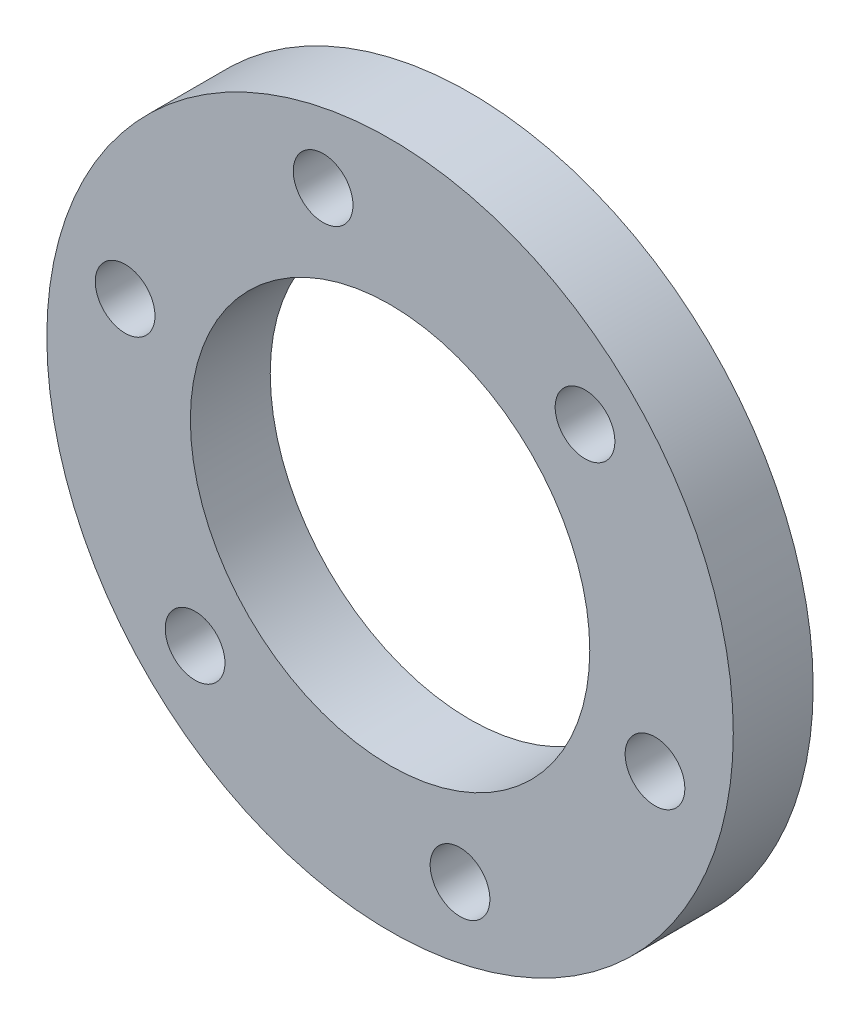
ISO-10303-21;
HEADER;
FILE_DESCRIPTION(('STEP AP214'),'2;1');
FILE_NAME('part.step','',(''),(''),'','','');
FILE_SCHEMA(('AUTOMOTIVE_DESIGN { 1 0 10303 214 1 1 1 1 }'));
ENDSEC;
DATA;
#1=APPLICATION_CONTEXT('core data for automotive mechanical design processes');
#2=APPLICATION_PROTOCOL_DEFINITION('international standard','automotive_design',2000,#1);
#3=PRODUCT_CONTEXT('',#1,'mechanical');
#4=PRODUCT('Part','Part','',(#3));
#5=PRODUCT_RELATED_PRODUCT_CATEGORY('part','',(#4));
#6=PRODUCT_DEFINITION_FORMATION('','',#4);
#7=PRODUCT_DEFINITION_CONTEXT('part definition',#1,'design');
#8=PRODUCT_DEFINITION('design','',#6,#7);
#9=PRODUCT_DEFINITION_SHAPE('','',#8);
#10=(LENGTH_UNIT() NAMED_UNIT(*) SI_UNIT(.MILLI.,.METRE.));
#11=(NAMED_UNIT(*) PLANE_ANGLE_UNIT() SI_UNIT($,.RADIAN.));
#12=(NAMED_UNIT(*) SI_UNIT($,.STERADIAN.) SOLID_ANGLE_UNIT());
#13=UNCERTAINTY_MEASURE_WITH_UNIT(LENGTH_MEASURE(1.E-05),#10,'distance_accuracy_value','');
#14=(GEOMETRIC_REPRESENTATION_CONTEXT(3) GLOBAL_UNCERTAINTY_ASSIGNED_CONTEXT((#13)) GLOBAL_UNIT_ASSIGNED_CONTEXT((#10,
#11,#12)) REPRESENTATION_CONTEXT('',''));
#15=CARTESIAN_POINT('',(0.,0.,0.));
#16=DIRECTION('',(0.,0.,1.));
#17=DIRECTION('',(1.,0.,0.));
#18=AXIS2_PLACEMENT_3D('',#15,#16,#17);
#19=CARTESIAN_POINT('',(0.,0.,5.08));
#20=DIRECTION('',(0.,0.,1.));
#21=DIRECTION('',(1.,0.,0.));
#22=AXIS2_PLACEMENT_3D('',#19,#20,#21);
#23=PLANE('',#22);
#24=CARTESIAN_POINT('',(-4.25743140135637,16.9819234902171,5.08));
#25=DIRECTION('',(0.,0.,1.));
#26=DIRECTION('',(1.,0.,0.));
#27=AXIS2_PLACEMENT_3D('',#24,#25,#26);
#28=CIRCLE('',#27,1.89865);
#29=CARTESIAN_POINT('',(-2.35878140135637,16.9819234902171,5.08));
#30=VERTEX_POINT('',#29);
#31=EDGE_CURVE('E83',#30,#30,#28,.T.);
#32=ORIENTED_EDGE('',*,*,#31,.F.);
#33=EDGE_LOOP('',(#32));
#34=FACE_BOUND('',#33,.T.);
#35=CARTESIAN_POINT('',(12.3986931859506,12.2968009470212,5.08));
#36=DIRECTION('',(0.,0.,1.));
#37=DIRECTION('',(1.,0.,0.));
#38=AXIS2_PLACEMENT_3D('',#35,#36,#37);
#39=CIRCLE('',#38,1.89865);
#40=CARTESIAN_POINT('',(14.2973431859506,12.2968009470212,5.08));
#41=VERTEX_POINT('',#40);
#42=EDGE_CURVE('E77',#41,#41,#39,.T.);
#43=ORIENTED_EDGE('',*,*,#42,.F.);
#44=EDGE_LOOP('',(#43));
#45=FACE_BOUND('',#44,.T.);
#46=CARTESIAN_POINT('',(16.8486885983762,-4.58918279925166,5.08));
#47=DIRECTION('',(0.,0.,1.));
#48=DIRECTION('',(1.,0.,0.));
#49=AXIS2_PLACEMENT_3D('',#46,#47,#48);
#50=CIRCLE('',#49,1.89865);
#51=CARTESIAN_POINT('',(18.7473385983762,-4.58918279925166,5.08));
#52=VERTEX_POINT('',#51);
#53=EDGE_CURVE('E71',#52,#52,#50,.T.);
#54=ORIENTED_EDGE('',*,*,#53,.F.);
#55=EDGE_LOOP('',(#54));
#56=FACE_BOUND('',#55,.T.);
#57=CARTESIAN_POINT('',(4.44999541242565,-16.8859837462728,5.08));
#58=DIRECTION('',(0.,0.,1.));
#59=DIRECTION('',(1.,0.,0.));
#60=AXIS2_PLACEMENT_3D('',#57,#58,#59);
#61=CIRCLE('',#60,1.89865);
#62=CARTESIAN_POINT('',(6.34864541242564,-16.8859837462728,5.08));
#63=VERTEX_POINT('',#62);
#64=EDGE_CURVE('E65',#63,#63,#61,.T.);
#65=ORIENTED_EDGE('',*,*,#64,.F.);
#66=EDGE_LOOP('',(#65));
#67=FACE_BOUND('',#66,.T.);
#68=CARTESIAN_POINT('',(-12.3986931859507,-12.2968009470211,5.08));
#69=DIRECTION('',(0.,0.,1.));
#70=DIRECTION('',(1.,0.,0.));
#71=AXIS2_PLACEMENT_3D('',#68,#69,#70);
#72=CIRCLE('',#71,1.89865);
#73=CARTESIAN_POINT('',(-10.5000431859507,-12.2968009470211,5.08));
#74=VERTEX_POINT('',#73);
#75=EDGE_CURVE('E59',#74,#74,#72,.T.);
#76=ORIENTED_EDGE('',*,*,#75,.F.);
#77=EDGE_LOOP('',(#76));
#78=FACE_BOUND('',#77,.T.);
#79=CARTESIAN_POINT('',(-16.8486885983762,4.58918279925179,5.08));
#80=DIRECTION('',(0.,0.,1.));
#81=DIRECTION('',(1.,0.,0.));
#82=AXIS2_PLACEMENT_3D('',#79,#80,#81);
#83=CIRCLE('',#82,1.89865);
#84=CARTESIAN_POINT('',(-14.9500385983762,4.58918279925179,5.08));
#85=VERTEX_POINT('',#84);
#86=EDGE_CURVE('E53',#85,#85,#83,.T.);
#87=ORIENTED_EDGE('',*,*,#86,.F.);
#88=EDGE_LOOP('',(#87));
#89=FACE_BOUND('',#88,.T.);
#90=CARTESIAN_POINT('',(0.,0.,5.08));
#91=DIRECTION('',(0.,0.,1.));
#92=DIRECTION('',(1.,0.,0.));
#93=AXIS2_PLACEMENT_3D('',#90,#91,#92);
#94=CIRCLE('',#93,21.828125);
#95=CARTESIAN_POINT('',(21.828125,0.,5.08));
#96=VERTEX_POINT('',#95);
#97=EDGE_CURVE('E10',#96,#96,#94,.T.);
#98=ORIENTED_EDGE('',*,*,#97,.T.);
#99=EDGE_LOOP('',(#98));
#100=FACE_BOUND('',#99,.T.);
#101=CARTESIAN_POINT('',(0.,0.,5.08));
#102=DIRECTION('',(0.,0.,1.));
#103=DIRECTION('',(1.,0.,0.));
#104=AXIS2_PLACEMENT_3D('',#101,#102,#103);
#105=CIRCLE('',#104,12.7);
#106=CARTESIAN_POINT('',(12.7,0.,5.08));
#107=VERTEX_POINT('',#106);
#108=EDGE_CURVE('E43',#107,#107,#105,.T.);
#109=ORIENTED_EDGE('',*,*,#108,.F.);
#110=EDGE_LOOP('',(#109));
#111=FACE_BOUND('',#110,.T.);
#112=ADVANCED_FACE('F32',(#34,#45,#56,#67,#78,#89,#100,#111),#23,.T.);
#113=CARTESIAN_POINT('',(0.,0.,0.));
#114=DIRECTION('',(0.,0.,1.));
#115=DIRECTION('',(1.,0.,0.));
#116=AXIS2_PLACEMENT_3D('',#113,#114,#115);
#117=PLANE('',#116);
#118=CARTESIAN_POINT('',(-4.25743140135637,16.9819234902171,0.));
#119=DIRECTION('',(0.,0.,1.));
#120=DIRECTION('',(1.,0.,0.));
#121=AXIS2_PLACEMENT_3D('',#118,#119,#120);
#122=CIRCLE('',#121,1.89865);
#123=CARTESIAN_POINT('',(-2.35878140135637,16.9819234902171,0.));
#124=VERTEX_POINT('',#123);
#125=EDGE_CURVE('E80',#124,#124,#122,.T.);
#126=ORIENTED_EDGE('',*,*,#125,.T.);
#127=EDGE_LOOP('',(#126));
#128=FACE_BOUND('',#127,.T.);
#129=CARTESIAN_POINT('',(12.3986931859506,12.2968009470212,0.));
#130=DIRECTION('',(0.,0.,1.));
#131=DIRECTION('',(1.,0.,0.));
#132=AXIS2_PLACEMENT_3D('',#129,#130,#131);
#133=CIRCLE('',#132,1.89865);
#134=CARTESIAN_POINT('',(14.2973431859506,12.2968009470212,0.));
#135=VERTEX_POINT('',#134);
#136=EDGE_CURVE('E74',#135,#135,#133,.T.);
#137=ORIENTED_EDGE('',*,*,#136,.T.);
#138=EDGE_LOOP('',(#137));
#139=FACE_BOUND('',#138,.T.);
#140=CARTESIAN_POINT('',(16.8486885983762,-4.58918279925166,0.));
#141=DIRECTION('',(0.,0.,1.));
#142=DIRECTION('',(1.,0.,0.));
#143=AXIS2_PLACEMENT_3D('',#140,#141,#142);
#144=CIRCLE('',#143,1.89864999999999);
#145=CARTESIAN_POINT('',(18.7473385983762,-4.58918279925166,0.));
#146=VERTEX_POINT('',#145);
#147=EDGE_CURVE('E68',#146,#146,#144,.T.);
#148=ORIENTED_EDGE('',*,*,#147,.T.);
#149=EDGE_LOOP('',(#148));
#150=FACE_BOUND('',#149,.T.);
#151=CARTESIAN_POINT('',(4.44999541242565,-16.8859837462728,0.));
#152=DIRECTION('',(0.,0.,1.));
#153=DIRECTION('',(1.,0.,0.));
#154=AXIS2_PLACEMENT_3D('',#151,#152,#153);
#155=CIRCLE('',#154,1.89865);
#156=CARTESIAN_POINT('',(6.34864541242564,-16.8859837462728,0.));
#157=VERTEX_POINT('',#156);
#158=EDGE_CURVE('E62',#157,#157,#155,.T.);
#159=ORIENTED_EDGE('',*,*,#158,.T.);
#160=EDGE_LOOP('',(#159));
#161=FACE_BOUND('',#160,.T.);
#162=CARTESIAN_POINT('',(-12.3986931859507,-12.2968009470211,0.));
#163=DIRECTION('',(0.,0.,1.));
#164=DIRECTION('',(1.,0.,0.));
#165=AXIS2_PLACEMENT_3D('',#162,#163,#164);
#166=CIRCLE('',#165,1.89865);
#167=CARTESIAN_POINT('',(-10.5000431859507,-12.2968009470211,0.));
#168=VERTEX_POINT('',#167);
#169=EDGE_CURVE('E56',#168,#168,#166,.T.);
#170=ORIENTED_EDGE('',*,*,#169,.T.);
#171=EDGE_LOOP('',(#170));
#172=FACE_BOUND('',#171,.T.);
#173=CARTESIAN_POINT('',(-16.8486885983762,4.58918279925179,0.));
#174=DIRECTION('',(0.,0.,1.));
#175=DIRECTION('',(1.,0.,0.));
#176=AXIS2_PLACEMENT_3D('',#173,#174,#175);
#177=CIRCLE('',#176,1.89865);
#178=CARTESIAN_POINT('',(-14.9500385983762,4.58918279925179,0.));
#179=VERTEX_POINT('',#178);
#180=EDGE_CURVE('E48',#179,#179,#177,.T.);
#181=ORIENTED_EDGE('',*,*,#180,.T.);
#182=EDGE_LOOP('',(#181));
#183=FACE_BOUND('',#182,.T.);
#184=CARTESIAN_POINT('',(0.,0.,0.));
#185=DIRECTION('',(0.,0.,1.));
#186=DIRECTION('',(1.,0.,0.));
#187=AXIS2_PLACEMENT_3D('',#184,#185,#186);
#188=CIRCLE('',#187,21.828125);
#189=CARTESIAN_POINT('',(21.828125,0.,0.));
#190=VERTEX_POINT('',#189);
#191=EDGE_CURVE('E36',#190,#190,#188,.T.);
#192=ORIENTED_EDGE('',*,*,#191,.F.);
#193=EDGE_LOOP('',(#192));
#194=FACE_BOUND('',#193,.T.);
#195=CARTESIAN_POINT('',(0.,0.,0.));
#196=DIRECTION('',(0.,0.,1.));
#197=DIRECTION('',(1.,0.,0.));
#198=AXIS2_PLACEMENT_3D('',#195,#196,#197);
#199=CIRCLE('',#198,12.7);
#200=CARTESIAN_POINT('',(12.7,0.,0.));
#201=VERTEX_POINT('',#200);
#202=EDGE_CURVE('E45',#201,#201,#199,.T.);
#203=ORIENTED_EDGE('',*,*,#202,.T.);
#204=EDGE_LOOP('',(#203));
#205=FACE_BOUND('',#204,.T.);
#206=ADVANCED_FACE('F91',(#128,#139,#150,#161,#172,#183,#194,#205),#117,.F.);
#207=CARTESIAN_POINT('',(0.,0.,5.08));
#208=DIRECTION('',(0.,0.,-1.));
#209=DIRECTION('',(-1.,0.,0.));
#210=AXIS2_PLACEMENT_3D('',#207,#208,#209);
#211=CYLINDRICAL_SURFACE('',#210,21.828125);
#212=ORIENTED_EDGE('',*,*,#97,.F.);
#213=EDGE_LOOP('',(#212));
#214=FACE_BOUND('',#213,.T.);
#215=ORIENTED_EDGE('',*,*,#191,.T.);
#216=EDGE_LOOP('',(#215));
#217=FACE_BOUND('',#216,.T.);
#218=ADVANCED_FACE('F34',(#214,#217),#211,.T.);
#219=CARTESIAN_POINT('',(0.,0.,5.08));
#220=DIRECTION('',(0.,0.,-1.));
#221=DIRECTION('',(-1.,0.,0.));
#222=AXIS2_PLACEMENT_3D('',#219,#220,#221);
#223=CYLINDRICAL_SURFACE('',#222,12.7);
#224=ORIENTED_EDGE('',*,*,#108,.T.);
#225=EDGE_LOOP('',(#224));
#226=FACE_BOUND('',#225,.T.);
#227=ORIENTED_EDGE('',*,*,#202,.F.);
#228=EDGE_LOOP('',(#227));
#229=FACE_BOUND('',#228,.T.);
#230=ADVANCED_FACE('F105',(#226,#229),#223,.F.);
#231=CARTESIAN_POINT('',(-16.8486885983762,4.58918279925179,5.08));
#232=DIRECTION('',(0.,0.,1.));
#233=DIRECTION('',(1.,0.,0.));
#234=AXIS2_PLACEMENT_3D('',#231,#232,#233);
#235=CYLINDRICAL_SURFACE('',#234,1.89865);
#236=ORIENTED_EDGE('',*,*,#180,.F.);
#237=EDGE_LOOP('',(#236));
#238=FACE_BOUND('',#237,.T.);
#239=ORIENTED_EDGE('',*,*,#86,.T.);
#240=EDGE_LOOP('',(#239));
#241=FACE_BOUND('',#240,.T.);
#242=ADVANCED_FACE('F108',(#238,#241),#235,.F.);
#243=CARTESIAN_POINT('',(-12.3986931859507,-12.2968009470211,5.08));
#244=DIRECTION('',(0.,0.,1.));
#245=DIRECTION('',(1.,0.,0.));
#246=AXIS2_PLACEMENT_3D('',#243,#244,#245);
#247=CYLINDRICAL_SURFACE('',#246,1.89865);
#248=ORIENTED_EDGE('',*,*,#169,.F.);
#249=EDGE_LOOP('',(#248));
#250=FACE_BOUND('',#249,.T.);
#251=ORIENTED_EDGE('',*,*,#75,.T.);
#252=EDGE_LOOP('',(#251));
#253=FACE_BOUND('',#252,.T.);
#254=ADVANCED_FACE('F122',(#250,#253),#247,.F.);
#255=CARTESIAN_POINT('',(4.44999541242565,-16.8859837462728,5.08));
#256=DIRECTION('',(0.,0.,1.));
#257=DIRECTION('',(1.,0.,0.));
#258=AXIS2_PLACEMENT_3D('',#255,#256,#257);
#259=CYLINDRICAL_SURFACE('',#258,1.89865);
#260=ORIENTED_EDGE('',*,*,#158,.F.);
#261=EDGE_LOOP('',(#260));
#262=FACE_BOUND('',#261,.T.);
#263=ORIENTED_EDGE('',*,*,#64,.T.);
#264=EDGE_LOOP('',(#263));
#265=FACE_BOUND('',#264,.T.);
#266=ADVANCED_FACE('F126',(#262,#265),#259,.F.);
#267=CARTESIAN_POINT('',(16.8486885983762,-4.58918279925166,5.08));
#268=DIRECTION('',(0.,0.,1.));
#269=DIRECTION('',(1.,0.,0.));
#270=AXIS2_PLACEMENT_3D('',#267,#268,#269);
#271=CYLINDRICAL_SURFACE('',#270,1.89865);
#272=ORIENTED_EDGE('',*,*,#147,.F.);
#273=EDGE_LOOP('',(#272));
#274=FACE_BOUND('',#273,.T.);
#275=ORIENTED_EDGE('',*,*,#53,.T.);
#276=EDGE_LOOP('',(#275));
#277=FACE_BOUND('',#276,.T.);
#278=ADVANCED_FACE('F130',(#274,#277),#271,.F.);
#279=CARTESIAN_POINT('',(12.3986931859506,12.2968009470212,5.08));
#280=DIRECTION('',(0.,0.,1.));
#281=DIRECTION('',(1.,0.,0.));
#282=AXIS2_PLACEMENT_3D('',#279,#280,#281);
#283=CYLINDRICAL_SURFACE('',#282,1.89865);
#284=ORIENTED_EDGE('',*,*,#136,.F.);
#285=EDGE_LOOP('',(#284));
#286=FACE_BOUND('',#285,.T.);
#287=ORIENTED_EDGE('',*,*,#42,.T.);
#288=EDGE_LOOP('',(#287));
#289=FACE_BOUND('',#288,.T.);
#290=ADVANCED_FACE('F134',(#286,#289),#283,.F.);
#291=CARTESIAN_POINT('',(-4.25743140135637,16.9819234902171,5.08));
#292=DIRECTION('',(0.,0.,1.));
#293=DIRECTION('',(1.,0.,0.));
#294=AXIS2_PLACEMENT_3D('',#291,#292,#293);
#295=CYLINDRICAL_SURFACE('',#294,1.89865);
#296=ORIENTED_EDGE('',*,*,#125,.F.);
#297=EDGE_LOOP('',(#296));
#298=FACE_BOUND('',#297,.T.);
#299=ORIENTED_EDGE('',*,*,#31,.T.);
#300=EDGE_LOOP('',(#299));
#301=FACE_BOUND('',#300,.T.);
#302=ADVANCED_FACE('F87',(#298,#301),#295,.F.);
#303=CLOSED_SHELL('',(#112,#206,#218,#230,#242,#254,#266,#278,#290,#302));
#304=MANIFOLD_SOLID_BREP('B2',#303);
#305=ADVANCED_BREP_SHAPE_REPRESENTATION('',(#18,#304),#14);
#306=SHAPE_DEFINITION_REPRESENTATION(#9,#305);
ENDSEC;
END-ISO-10303-21;
